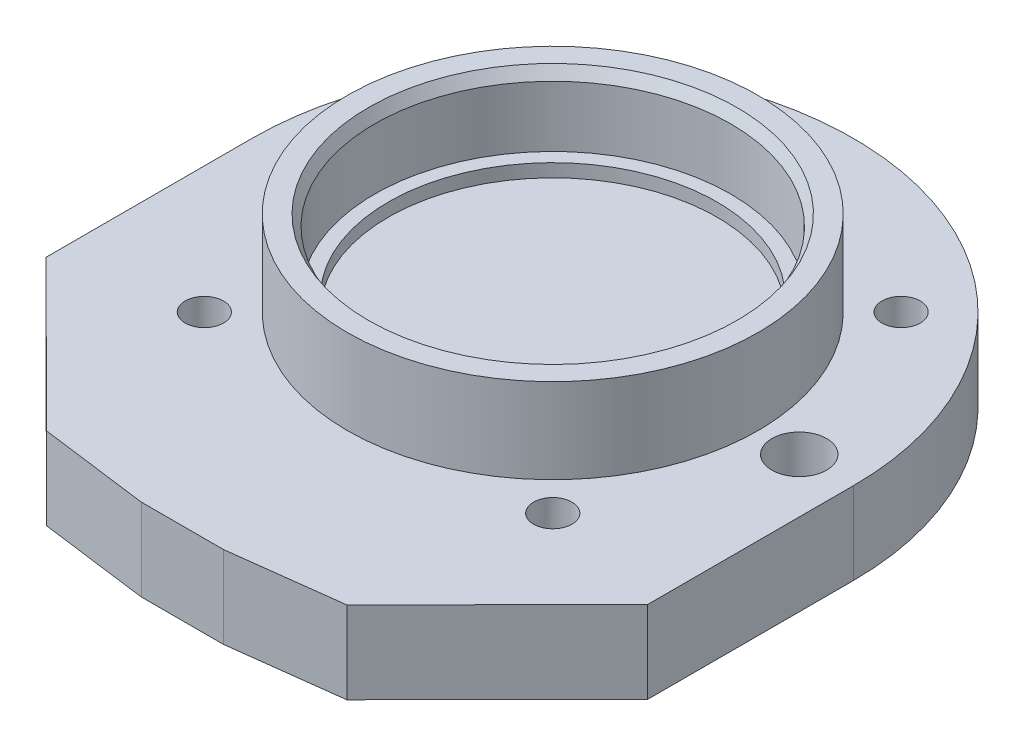
ISO-10303-21;
HEADER;
FILE_DESCRIPTION(('STEP AP214'),'2;1');
FILE_NAME('part.step','',(''),(''),'','','');
FILE_SCHEMA(('AUTOMOTIVE_DESIGN { 1 0 10303 214 1 1 1 1 }'));
ENDSEC;
DATA;
#1=APPLICATION_CONTEXT('core data for automotive mechanical design processes');
#2=APPLICATION_PROTOCOL_DEFINITION('international standard','automotive_design',2000,#1);
#3=PRODUCT_CONTEXT('',#1,'mechanical');
#4=PRODUCT('Part','Part','',(#3));
#5=PRODUCT_RELATED_PRODUCT_CATEGORY('part','',(#4));
#6=PRODUCT_DEFINITION_FORMATION('','',#4);
#7=PRODUCT_DEFINITION_CONTEXT('part definition',#1,'design');
#8=PRODUCT_DEFINITION('design','',#6,#7);
#9=PRODUCT_DEFINITION_SHAPE('','',#8);
#10=(LENGTH_UNIT() NAMED_UNIT(*) SI_UNIT(.MILLI.,.METRE.));
#11=(NAMED_UNIT(*) PLANE_ANGLE_UNIT() SI_UNIT($,.RADIAN.));
#12=(NAMED_UNIT(*) SI_UNIT($,.STERADIAN.) SOLID_ANGLE_UNIT());
#13=UNCERTAINTY_MEASURE_WITH_UNIT(LENGTH_MEASURE(1.E-05),#10,'distance_accuracy_value','');
#14=(GEOMETRIC_REPRESENTATION_CONTEXT(3) GLOBAL_UNCERTAINTY_ASSIGNED_CONTEXT((#13)) GLOBAL_UNIT_ASSIGNED_CONTEXT((#10,
#11,#12)) REPRESENTATION_CONTEXT('',''));
#15=CARTESIAN_POINT('',(0.,0.,0.));
#16=DIRECTION('',(0.,0.,1.));
#17=DIRECTION('',(1.,0.,0.));
#18=AXIS2_PLACEMENT_3D('',#15,#16,#17);
#19=CARTESIAN_POINT('',(0.,30.,0.));
#20=DIRECTION('',(0.,1.,0.));
#21=DIRECTION('',(0.,0.,1.));
#22=AXIS2_PLACEMENT_3D('',#19,#20,#21);
#23=PLANE('',#22);
#24=CARTESIAN_POINT('',(0.,30.,0.));
#25=DIRECTION('',(0.,1.,0.));
#26=DIRECTION('',(0.,0.,1.));
#27=AXIS2_PLACEMENT_3D('',#24,#25,#26);
#28=CIRCLE('',#27,60.);
#29=CARTESIAN_POINT('',(0.,30.,60.));
#30=VERTEX_POINT('',#29);
#31=EDGE_CURVE('E19',#30,#30,#28,.T.);
#32=ORIENTED_EDGE('',*,*,#31,.T.);
#33=EDGE_LOOP('',(#32));
#34=FACE_BOUND('',#33,.T.);
#35=ADVANCED_FACE('F16',(#34),#23,.T.);
#36=CARTESIAN_POINT('',(0.,34.8,0.));
#37=DIRECTION('',(0.,1.,0.));
#38=DIRECTION('',(0.,0.,1.));
#39=AXIS2_PLACEMENT_3D('',#36,#37,#38);
#40=CYLINDRICAL_SURFACE('',#39,60.);
#41=ORIENTED_EDGE('',*,*,#31,.F.);
#42=EDGE_LOOP('',(#41));
#43=FACE_BOUND('',#42,.T.);
#44=CARTESIAN_POINT('',(0.,34.8,0.));
#45=DIRECTION('',(0.,1.,0.));
#46=DIRECTION('',(0.,0.,1.));
#47=AXIS2_PLACEMENT_3D('',#44,#45,#46);
#48=CIRCLE('',#47,60.);
#49=CARTESIAN_POINT('',(0.,34.8,60.));
#50=VERTEX_POINT('',#49);
#51=EDGE_CURVE('E204',#50,#50,#48,.F.);
#52=ORIENTED_EDGE('',*,*,#51,.F.);
#53=EDGE_LOOP('',(#52));
#54=FACE_BOUND('',#53,.T.);
#55=ADVANCED_FACE('F212',(#43,#54),#40,.F.);
#56=CARTESIAN_POINT('',(0.,34.8,0.));
#57=DIRECTION('',(0.,1.,0.));
#58=DIRECTION('',(0.,0.,1.));
#59=AXIS2_PLACEMENT_3D('',#56,#57,#58);
#60=PLANE('',#59);
#61=ORIENTED_EDGE('',*,*,#51,.T.);
#62=EDGE_LOOP('',(#61));
#63=FACE_BOUND('',#62,.T.);
#64=CARTESIAN_POINT('',(0.,34.8,0.));
#65=DIRECTION('',(0.,1.,0.));
#66=DIRECTION('',(0.,0.,1.));
#67=AXIS2_PLACEMENT_3D('',#64,#65,#66);
#68=CIRCLE('',#67,65.);
#69=CARTESIAN_POINT('',(0.,34.8,65.));
#70=VERTEX_POINT('',#69);
#71=EDGE_CURVE('E202',#70,#70,#68,.T.);
#72=ORIENTED_EDGE('',*,*,#71,.T.);
#73=EDGE_LOOP('',(#72));
#74=FACE_BOUND('',#73,.T.);
#75=ADVANCED_FACE('F215',(#63,#74),#60,.T.);
#76=CARTESIAN_POINT('',(0.,61.,0.));
#77=DIRECTION('',(0.,1.,0.));
#78=DIRECTION('',(0.,0.,1.));
#79=AXIS2_PLACEMENT_3D('',#76,#77,#78);
#80=CYLINDRICAL_SURFACE('',#79,65.);
#81=ORIENTED_EDGE('',*,*,#71,.F.);
#82=EDGE_LOOP('',(#81));
#83=FACE_BOUND('',#82,.T.);
#84=CARTESIAN_POINT('',(4.90274487674E-13,56.999925434073,0.));
#85=DIRECTION('',(0.,1.,0.));
#86=DIRECTION('',(0.,0.,1.));
#87=AXIS2_PLACEMENT_3D('',#84,#85,#86);
#88=CIRCLE('',#87,65.);
#89=CARTESIAN_POINT('',(4.90274487674E-13,56.999925434073,64.9999999999999));
#90=VERTEX_POINT('',#89);
#91=EDGE_CURVE('E199',#90,#90,#88,.T.);
#92=ORIENTED_EDGE('',*,*,#91,.T.);
#93=EDGE_LOOP('',(#92));
#94=FACE_BOUND('',#93,.T.);
#95=ADVANCED_FACE('F221',(#83,#94),#80,.F.);
#96=CARTESIAN_POINT('',(4.90274487674E-13,60.9999806962001,0.));
#97=DIRECTION('',(0.,1.,0.));
#98=DIRECTION('',(0.,0.,1.));
#99=AXIS2_PLACEMENT_3D('',#96,#97,#98);
#100=CONICAL_SURFACE('',#99,67.3094345119396,0.523599062390001);
#101=ORIENTED_EDGE('',*,*,#91,.F.);
#102=EDGE_LOOP('',(#101));
#103=FACE_BOUND('',#102,.T.);
#104=CARTESIAN_POINT('',(4.90274487674E-13,61.,0.));
#105=DIRECTION('',(0.,1.,0.));
#106=DIRECTION('',(0.,0.,1.));
#107=AXIS2_PLACEMENT_3D('',#104,#105,#106);
#108=CIRCLE('',#107,67.309445657001);
#109=CARTESIAN_POINT('',(4.90274487674E-13,61.,67.3094456570009));
#110=VERTEX_POINT('',#109);
#111=EDGE_CURVE('E196',#110,#110,#108,.F.);
#112=ORIENTED_EDGE('',*,*,#111,.F.);
#113=EDGE_LOOP('',(#112));
#114=FACE_BOUND('',#113,.T.);
#115=ADVANCED_FACE('F321',(#103,#114),#100,.F.);
#116=CARTESIAN_POINT('',(0.,61.,0.));
#117=DIRECTION('',(0.,1.,0.));
#118=DIRECTION('',(0.,0.,1.));
#119=AXIS2_PLACEMENT_3D('',#116,#117,#118);
#120=PLANE('',#119);
#121=ORIENTED_EDGE('',*,*,#111,.T.);
#122=EDGE_LOOP('',(#121));
#123=FACE_BOUND('',#122,.T.);
#124=CARTESIAN_POINT('',(0.,61.,0.));
#125=DIRECTION('',(0.,1.,0.));
#126=DIRECTION('',(0.,0.,1.));
#127=AXIS2_PLACEMENT_3D('',#124,#125,#126);
#128=CIRCLE('',#127,75.);
#129=CARTESIAN_POINT('',(0.,61.,75.));
#130=VERTEX_POINT('',#129);
#131=EDGE_CURVE('E193',#130,#130,#128,.F.);
#132=ORIENTED_EDGE('',*,*,#131,.F.);
#133=EDGE_LOOP('',(#132));
#134=FACE_BOUND('',#133,.T.);
#135=ADVANCED_FACE('F317',(#123,#134),#120,.T.);
#136=CARTESIAN_POINT('',(0.,30.,0.));
#137=DIRECTION('',(0.,1.,0.));
#138=DIRECTION('',(0.,0.,1.));
#139=AXIS2_PLACEMENT_3D('',#136,#137,#138);
#140=CYLINDRICAL_SURFACE('',#139,75.);
#141=ORIENTED_EDGE('',*,*,#131,.T.);
#142=EDGE_LOOP('',(#141));
#143=FACE_BOUND('',#142,.T.);
#144=CARTESIAN_POINT('',(0.,30.,0.));
#145=DIRECTION('',(0.,1.,0.));
#146=DIRECTION('',(0.,0.,1.));
#147=AXIS2_PLACEMENT_3D('',#144,#145,#146);
#148=CIRCLE('',#147,75.);
#149=CARTESIAN_POINT('',(0.,30.,75.));
#150=VERTEX_POINT('',#149);
#151=EDGE_CURVE('E178',#150,#150,#148,.F.);
#152=ORIENTED_EDGE('',*,*,#151,.F.);
#153=EDGE_LOOP('',(#152));
#154=FACE_BOUND('',#153,.T.);
#155=ADVANCED_FACE('F313',(#143,#154),#140,.T.);
#156=CARTESIAN_POINT('',(-63.6,16.,-63.6));
#157=DIRECTION('',(0.,-1.,0.));
#158=DIRECTION('',(0.,0.,-1.));
#159=AXIS2_PLACEMENT_3D('',#156,#157,#158);
#160=CYLINDRICAL_SURFACE('',#159,7.);
#161=CARTESIAN_POINT('',(-63.6,16.,-63.6));
#162=DIRECTION('',(0.,-1.,0.));
#163=DIRECTION('',(0.,0.,-1.));
#164=AXIS2_PLACEMENT_3D('',#161,#162,#163);
#165=CIRCLE('',#164,7.);
#166=CARTESIAN_POINT('',(-63.6,16.,-70.6));
#167=VERTEX_POINT('',#166);
#168=EDGE_CURVE('E190',#167,#167,#165,.F.);
#169=ORIENTED_EDGE('',*,*,#168,.F.);
#170=EDGE_LOOP('',(#169));
#171=FACE_BOUND('',#170,.T.);
#172=CARTESIAN_POINT('',(-63.6,30.,-63.6));
#173=DIRECTION('',(0.,-1.,0.));
#174=DIRECTION('',(0.,0.,-1.));
#175=AXIS2_PLACEMENT_3D('',#172,#173,#174);
#176=CIRCLE('',#175,7.);
#177=CARTESIAN_POINT('',(-63.6,30.,-70.6));
#178=VERTEX_POINT('',#177);
#179=EDGE_CURVE('E175',#178,#178,#176,.T.);
#180=ORIENTED_EDGE('',*,*,#179,.F.);
#181=EDGE_LOOP('',(#180));
#182=FACE_BOUND('',#181,.T.);
#183=ADVANCED_FACE('F309',(#171,#182),#160,.F.);
#184=CARTESIAN_POINT('',(-63.6,16.,63.6));
#185=DIRECTION('',(0.,-1.,0.));
#186=DIRECTION('',(0.,0.,-1.));
#187=AXIS2_PLACEMENT_3D('',#184,#185,#186);
#188=CYLINDRICAL_SURFACE('',#187,7.);
#189=CARTESIAN_POINT('',(-63.6,16.,63.6));
#190=DIRECTION('',(0.,-1.,0.));
#191=DIRECTION('',(0.,0.,-1.));
#192=AXIS2_PLACEMENT_3D('',#189,#190,#191);
#193=CIRCLE('',#192,7.);
#194=CARTESIAN_POINT('',(-63.6,16.,56.6));
#195=VERTEX_POINT('',#194);
#196=EDGE_CURVE('E187',#195,#195,#193,.F.);
#197=ORIENTED_EDGE('',*,*,#196,.F.);
#198=EDGE_LOOP('',(#197));
#199=FACE_BOUND('',#198,.T.);
#200=CARTESIAN_POINT('',(-63.6,30.,63.6));
#201=DIRECTION('',(0.,-1.,0.));
#202=DIRECTION('',(0.,0.,-1.));
#203=AXIS2_PLACEMENT_3D('',#200,#201,#202);
#204=CIRCLE('',#203,7.);
#205=CARTESIAN_POINT('',(-63.6,30.,56.6));
#206=VERTEX_POINT('',#205);
#207=EDGE_CURVE('E172',#206,#206,#204,.T.);
#208=ORIENTED_EDGE('',*,*,#207,.F.);
#209=EDGE_LOOP('',(#208));
#210=FACE_BOUND('',#209,.T.);
#211=ADVANCED_FACE('F305',(#199,#210),#188,.F.);
#212=CARTESIAN_POINT('',(63.6,16.,63.6));
#213=DIRECTION('',(0.,-1.,0.));
#214=DIRECTION('',(0.,0.,-1.));
#215=AXIS2_PLACEMENT_3D('',#212,#213,#214);
#216=CYLINDRICAL_SURFACE('',#215,7.);
#217=CARTESIAN_POINT('',(63.6,16.,63.6));
#218=DIRECTION('',(0.,-1.,0.));
#219=DIRECTION('',(0.,0.,-1.));
#220=AXIS2_PLACEMENT_3D('',#217,#218,#219);
#221=CIRCLE('',#220,7.);
#222=CARTESIAN_POINT('',(63.6,16.,56.6));
#223=VERTEX_POINT('',#222);
#224=EDGE_CURVE('E184',#223,#223,#221,.F.);
#225=ORIENTED_EDGE('',*,*,#224,.F.);
#226=EDGE_LOOP('',(#225));
#227=FACE_BOUND('',#226,.T.);
#228=CARTESIAN_POINT('',(63.6,30.,63.6));
#229=DIRECTION('',(0.,-1.,0.));
#230=DIRECTION('',(0.,0.,-1.));
#231=AXIS2_PLACEMENT_3D('',#228,#229,#230);
#232=CIRCLE('',#231,7.);
#233=CARTESIAN_POINT('',(63.6,30.,56.6));
#234=VERTEX_POINT('',#233);
#235=EDGE_CURVE('E169',#234,#234,#232,.T.);
#236=ORIENTED_EDGE('',*,*,#235,.F.);
#237=EDGE_LOOP('',(#236));
#238=FACE_BOUND('',#237,.T.);
#239=ADVANCED_FACE('F301',(#227,#238),#216,.F.);
#240=CARTESIAN_POINT('',(63.6,16.,-63.6));
#241=DIRECTION('',(0.,-1.,0.));
#242=DIRECTION('',(0.,0.,-1.));
#243=AXIS2_PLACEMENT_3D('',#240,#241,#242);
#244=CYLINDRICAL_SURFACE('',#243,7.);
#245=CARTESIAN_POINT('',(63.6,16.,-63.6));
#246=DIRECTION('',(0.,-1.,0.));
#247=DIRECTION('',(0.,0.,-1.));
#248=AXIS2_PLACEMENT_3D('',#245,#246,#247);
#249=CIRCLE('',#248,7.);
#250=CARTESIAN_POINT('',(63.6,16.,-70.6));
#251=VERTEX_POINT('',#250);
#252=EDGE_CURVE('E181',#251,#251,#249,.F.);
#253=ORIENTED_EDGE('',*,*,#252,.F.);
#254=EDGE_LOOP('',(#253));
#255=FACE_BOUND('',#254,.T.);
#256=CARTESIAN_POINT('',(63.6,30.,-63.6));
#257=DIRECTION('',(0.,-1.,0.));
#258=DIRECTION('',(0.,0.,-1.));
#259=AXIS2_PLACEMENT_3D('',#256,#257,#258);
#260=CIRCLE('',#259,7.);
#261=CARTESIAN_POINT('',(63.6,30.,-70.6));
#262=VERTEX_POINT('',#261);
#263=EDGE_CURVE('E98',#262,#262,#260,.T.);
#264=ORIENTED_EDGE('',*,*,#263,.F.);
#265=EDGE_LOOP('',(#264));
#266=FACE_BOUND('',#265,.T.);
#267=ADVANCED_FACE('F297',(#255,#266),#244,.F.);
#268=CARTESIAN_POINT('',(0.,16.,0.));
#269=DIRECTION('',(0.,-1.,0.));
#270=DIRECTION('',(0.,0.,-1.));
#271=AXIS2_PLACEMENT_3D('',#268,#269,#270);
#272=PLANE('',#271);
#273=ORIENTED_EDGE('',*,*,#168,.T.);
#274=EDGE_LOOP('',(#273));
#275=FACE_BOUND('',#274,.T.);
#276=CARTESIAN_POINT('',(-63.6,16.,-63.6));
#277=DIRECTION('',(0.,-1.,0.));
#278=DIRECTION('',(0.,0.,-1.));
#279=AXIS2_PLACEMENT_3D('',#276,#277,#278);
#280=CIRCLE('',#279,10.);
#281=CARTESIAN_POINT('',(-63.6,16.,-73.6));
#282=VERTEX_POINT('',#281);
#283=EDGE_CURVE('E164',#282,#282,#280,.T.);
#284=ORIENTED_EDGE('',*,*,#283,.T.);
#285=EDGE_LOOP('',(#284));
#286=FACE_BOUND('',#285,.T.);
#287=ADVANCED_FACE('F293',(#275,#286),#272,.T.);
#288=CARTESIAN_POINT('',(0.,16.,0.));
#289=DIRECTION('',(0.,-1.,0.));
#290=DIRECTION('',(0.,0.,-1.));
#291=AXIS2_PLACEMENT_3D('',#288,#289,#290);
#292=PLANE('',#291);
#293=ORIENTED_EDGE('',*,*,#196,.T.);
#294=EDGE_LOOP('',(#293));
#295=FACE_BOUND('',#294,.T.);
#296=CARTESIAN_POINT('',(-63.6,16.,63.6));
#297=DIRECTION('',(0.,-1.,0.));
#298=DIRECTION('',(0.,0.,-1.));
#299=AXIS2_PLACEMENT_3D('',#296,#297,#298);
#300=CIRCLE('',#299,10.);
#301=CARTESIAN_POINT('',(-63.6,16.,53.6));
#302=VERTEX_POINT('',#301);
#303=EDGE_CURVE('E161',#302,#302,#300,.T.);
#304=ORIENTED_EDGE('',*,*,#303,.T.);
#305=EDGE_LOOP('',(#304));
#306=FACE_BOUND('',#305,.T.);
#307=ADVANCED_FACE('F289',(#295,#306),#292,.T.);
#308=CARTESIAN_POINT('',(0.,16.,0.));
#309=DIRECTION('',(0.,-1.,0.));
#310=DIRECTION('',(0.,0.,-1.));
#311=AXIS2_PLACEMENT_3D('',#308,#309,#310);
#312=PLANE('',#311);
#313=ORIENTED_EDGE('',*,*,#224,.T.);
#314=EDGE_LOOP('',(#313));
#315=FACE_BOUND('',#314,.T.);
#316=CARTESIAN_POINT('',(63.6,16.,63.6));
#317=DIRECTION('',(0.,-1.,0.));
#318=DIRECTION('',(0.,0.,-1.));
#319=AXIS2_PLACEMENT_3D('',#316,#317,#318);
#320=CIRCLE('',#319,10.);
#321=CARTESIAN_POINT('',(63.6,16.,53.6));
#322=VERTEX_POINT('',#321);
#323=EDGE_CURVE('E158',#322,#322,#320,.T.);
#324=ORIENTED_EDGE('',*,*,#323,.T.);
#325=EDGE_LOOP('',(#324));
#326=FACE_BOUND('',#325,.T.);
#327=ADVANCED_FACE('F285',(#315,#326),#312,.T.);
#328=CARTESIAN_POINT('',(0.,16.,0.));
#329=DIRECTION('',(0.,-1.,0.));
#330=DIRECTION('',(0.,0.,-1.));
#331=AXIS2_PLACEMENT_3D('',#328,#329,#330);
#332=PLANE('',#331);
#333=ORIENTED_EDGE('',*,*,#252,.T.);
#334=EDGE_LOOP('',(#333));
#335=FACE_BOUND('',#334,.T.);
#336=CARTESIAN_POINT('',(63.6,16.,-63.6));
#337=DIRECTION('',(0.,-1.,0.));
#338=DIRECTION('',(0.,0.,-1.));
#339=AXIS2_PLACEMENT_3D('',#336,#337,#338);
#340=CIRCLE('',#339,10.);
#341=CARTESIAN_POINT('',(63.6,16.,-73.6));
#342=VERTEX_POINT('',#341);
#343=EDGE_CURVE('E155',#342,#342,#340,.T.);
#344=ORIENTED_EDGE('',*,*,#343,.T.);
#345=EDGE_LOOP('',(#344));
#346=FACE_BOUND('',#345,.T.);
#347=ADVANCED_FACE('F281',(#335,#346),#332,.T.);
#348=CARTESIAN_POINT('',(0.,30.,0.));
#349=DIRECTION('',(0.,1.,0.));
#350=DIRECTION('',(0.,0.,1.));
#351=AXIS2_PLACEMENT_3D('',#348,#349,#350);
#352=PLANE('',#351);
#353=CARTESIAN_POINT('',(90.,30.,0.));
#354=DIRECTION('',(0.,-1.,0.));
#355=DIRECTION('',(0.,0.,-1.));
#356=AXIS2_PLACEMENT_3D('',#353,#354,#355);
#357=CIRCLE('',#356,10.);
#358=CARTESIAN_POINT('',(90.,30.,-10.));
#359=VERTEX_POINT('',#358);
#360=EDGE_CURVE('E152',#359,#359,#357,.T.);
#361=ORIENTED_EDGE('',*,*,#360,.T.);
#362=EDGE_LOOP('',(#361));
#363=FACE_BOUND('',#362,.T.);
#364=ORIENTED_EDGE('',*,*,#263,.T.);
#365=EDGE_LOOP('',(#364));
#366=FACE_BOUND('',#365,.T.);
#367=ORIENTED_EDGE('',*,*,#235,.T.);
#368=EDGE_LOOP('',(#367));
#369=FACE_BOUND('',#368,.T.);
#370=ORIENTED_EDGE('',*,*,#207,.T.);
#371=EDGE_LOOP('',(#370));
#372=FACE_BOUND('',#371,.T.);
#373=ORIENTED_EDGE('',*,*,#179,.T.);
#374=EDGE_LOOP('',(#373));
#375=FACE_BOUND('',#374,.T.);
#376=ORIENTED_EDGE('',*,*,#151,.T.);
#377=EDGE_LOOP('',(#376));
#378=FACE_BOUND('',#377,.T.);
#379=DIRECTION('',(0.,0.,-1.));
#380=VECTOR('',#379,1.);
#381=CARTESIAN_POINT('',(109.8,30.,75.2));
#382=LINE('',#381,#380);
#383=CARTESIAN_POINT('',(109.8,30.,0.));
#384=VERTEX_POINT('',#383);
#385=CARTESIAN_POINT('',(109.799999999995,30.,75.1999999999948));
#386=VERTEX_POINT('',#385);
#387=EDGE_CURVE('E94',#384,#386,#382,.F.);
#388=ORIENTED_EDGE('',*,*,#387,.F.);
#389=CARTESIAN_POINT('',(0.,30.,0.));
#390=DIRECTION('',(0.,1.,0.));
#391=DIRECTION('',(0.,0.,1.));
#392=AXIS2_PLACEMENT_3D('',#389,#390,#391);
#393=CIRCLE('',#392,109.8);
#394=CARTESIAN_POINT('',(-109.8,30.,0.));
#395=VERTEX_POINT('',#394);
#396=EDGE_CURVE('E88',#395,#384,#393,.F.);
#397=ORIENTED_EDGE('',*,*,#396,.F.);
#398=DIRECTION('',(0.,0.,1.));
#399=VECTOR('',#398,1.);
#400=CARTESIAN_POINT('',(-109.8,30.,0.));
#401=LINE('',#400,#399);
#402=CARTESIAN_POINT('',(-109.8,30.,75.2));
#403=VERTEX_POINT('',#402);
#404=EDGE_CURVE('E78',#403,#395,#401,.F.);
#405=ORIENTED_EDGE('',*,*,#404,.F.);
#406=DIRECTION('',(0.708393596513729,0.,0.70581761979873));
#407=VECTOR('',#406,1.);
#408=CARTESIAN_POINT('',(-109.8,30.,75.2));
#409=LINE('',#408,#407);
#410=CARTESIAN_POINT('',(-54.7999999999948,30.,129.999999999995));
#411=VERTEX_POINT('',#410);
#412=EDGE_CURVE('E103',#411,#403,#409,.F.);
#413=ORIENTED_EDGE('',*,*,#412,.F.);
#414=DIRECTION('',(0.991572603304275,0.,0.129552199427036));
#415=VECTOR('',#414,1.);
#416=CARTESIAN_POINT('',(-54.8,30.,130.));
#417=LINE('',#416,#415);
#418=CARTESIAN_POINT('',(-15.0000000000006,30.,135.200000000005));
#419=VERTEX_POINT('',#418);
#420=EDGE_CURVE('E130',#419,#411,#417,.F.);
#421=ORIENTED_EDGE('',*,*,#420,.F.);
#422=DIRECTION('',(1.,0.,0.));
#423=VECTOR('',#422,1.);
#424=CARTESIAN_POINT('',(-15.,30.,135.2));
#425=LINE('',#424,#423);
#426=CARTESIAN_POINT('',(15.,30.,135.2));
#427=VERTEX_POINT('',#426);
#428=EDGE_CURVE('E125',#427,#419,#425,.F.);
#429=ORIENTED_EDGE('',*,*,#428,.F.);
#430=DIRECTION('',(0.992277876713698,0.,-0.124034734588962));
#431=VECTOR('',#430,1.);
#432=CARTESIAN_POINT('',(15.,30.,135.2));
#433=LINE('',#432,#431);
#434=CARTESIAN_POINT('',(55.0000000000004,30.,130.200000000003));
#435=VERTEX_POINT('',#434);
#436=EDGE_CURVE('E120',#435,#427,#433,.F.);
#437=ORIENTED_EDGE('',*,*,#436,.F.);
#438=DIRECTION('',(0.70581761979873,0.,-0.708393596513729));
#439=VECTOR('',#438,1.);
#440=CARTESIAN_POINT('',(55.,30.,130.2));
#441=LINE('',#440,#439);
#442=EDGE_CURVE('E110',#386,#435,#441,.F.);
#443=ORIENTED_EDGE('',*,*,#442,.F.);
#444=EDGE_LOOP('',(#388,#397,#405,#413,#421,#429,#437,#443));
#445=FACE_BOUND('',#444,.T.);
#446=ADVANCED_FACE('F92',(#363,#366,#369,#372,#375,#378,#445),#352,.T.);
#447=CARTESIAN_POINT('',(0.,0.,0.));
#448=DIRECTION('',(0.,1.,0.));
#449=DIRECTION('',(0.,0.,1.));
#450=AXIS2_PLACEMENT_3D('',#447,#448,#449);
#451=CYLINDRICAL_SURFACE('',#450,109.8);
#452=DIRECTION('',(0.,1.,0.));
#453=VECTOR('',#452,1.);
#454=CARTESIAN_POINT('',(109.8,0.,0.));
#455=LINE('',#454,#453);
#456=CARTESIAN_POINT('',(109.8,0.,0.));
#457=VERTEX_POINT('',#456);
#458=EDGE_CURVE('E117',#457,#384,#455,.T.);
#459=ORIENTED_EDGE('',*,*,#458,.F.);
#460=CARTESIAN_POINT('',(0.,0.,0.));
#461=DIRECTION('',(0.,1.,0.));
#462=DIRECTION('',(0.,0.,1.));
#463=AXIS2_PLACEMENT_3D('',#460,#461,#462);
#464=CIRCLE('',#463,109.8);
#465=CARTESIAN_POINT('',(-109.8,0.,0.));
#466=VERTEX_POINT('',#465);
#467=EDGE_CURVE('E102',#457,#466,#464,.T.);
#468=ORIENTED_EDGE('',*,*,#467,.T.);
#469=DIRECTION('',(0.,1.,0.));
#470=VECTOR('',#469,1.);
#471=CARTESIAN_POINT('',(-109.8,0.,0.));
#472=LINE('',#471,#470);
#473=EDGE_CURVE('E83',#395,#466,#472,.F.);
#474=ORIENTED_EDGE('',*,*,#473,.F.);
#475=ORIENTED_EDGE('',*,*,#396,.T.);
#476=EDGE_LOOP('',(#459,#468,#474,#475));
#477=FACE_BOUND('',#476,.T.);
#478=ADVANCED_FACE('F101',(#477),#451,.T.);
#479=CARTESIAN_POINT('',(-109.8,0.,0.));
#480=DIRECTION('',(-1.,0.,0.));
#481=DIRECTION('',(0.,0.,1.));
#482=AXIS2_PLACEMENT_3D('',#479,#480,#481);
#483=PLANE('',#482);
#484=ORIENTED_EDGE('',*,*,#473,.T.);
#485=DIRECTION('',(0.,0.,1.));
#486=VECTOR('',#485,1.);
#487=CARTESIAN_POINT('',(-109.8,0.,0.));
#488=LINE('',#487,#486);
#489=CARTESIAN_POINT('',(-109.8,0.,75.2));
#490=VERTEX_POINT('',#489);
#491=EDGE_CURVE('E151',#466,#490,#488,.T.);
#492=ORIENTED_EDGE('',*,*,#491,.T.);
#493=DIRECTION('',(0.,1.,0.));
#494=VECTOR('',#493,1.);
#495=CARTESIAN_POINT('',(-109.8,0.,75.2));
#496=LINE('',#495,#494);
#497=EDGE_CURVE('E85',#403,#490,#496,.F.);
#498=ORIENTED_EDGE('',*,*,#497,.F.);
#499=ORIENTED_EDGE('',*,*,#404,.T.);
#500=EDGE_LOOP('',(#484,#492,#498,#499));
#501=FACE_BOUND('',#500,.T.);
#502=ADVANCED_FACE('F80',(#501),#483,.T.);
#503=CARTESIAN_POINT('',(-109.8,0.,75.2));
#504=DIRECTION('',(-0.70581761979873,0.,0.708393596513729));
#505=DIRECTION('',(0.708393596513729,0.,0.70581761979873));
#506=AXIS2_PLACEMENT_3D('',#503,#504,#505);
#507=PLANE('',#506);
#508=ORIENTED_EDGE('',*,*,#497,.T.);
#509=DIRECTION('',(0.708393596513527,0.,0.705817619798932));
#510=VECTOR('',#509,1.);
#511=CARTESIAN_POINT('',(-109.8,0.,75.2));
#512=LINE('',#511,#510);
#513=CARTESIAN_POINT('',(-54.8,0.,130.));
#514=VERTEX_POINT('',#513);
#515=EDGE_CURVE('E568',#490,#514,#512,.T.);
#516=ORIENTED_EDGE('',*,*,#515,.T.);
#517=DIRECTION('',(0.,1.,0.));
#518=VECTOR('',#517,1.);
#519=CARTESIAN_POINT('',(-54.8,0.,130.));
#520=LINE('',#519,#518);
#521=EDGE_CURVE('E127',#411,#514,#520,.F.);
#522=ORIENTED_EDGE('',*,*,#521,.F.);
#523=ORIENTED_EDGE('',*,*,#412,.T.);
#524=EDGE_LOOP('',(#508,#516,#522,#523));
#525=FACE_BOUND('',#524,.T.);
#526=ADVANCED_FACE('F270',(#525),#507,.T.);
#527=CARTESIAN_POINT('',(-54.8,0.,130.));
#528=DIRECTION('',(-0.129552199427036,0.,0.991572603304275));
#529=DIRECTION('',(0.991572603304275,0.,0.129552199427036));
#530=AXIS2_PLACEMENT_3D('',#527,#528,#529);
#531=PLANE('',#530);
#532=ORIENTED_EDGE('',*,*,#521,.T.);
#533=DIRECTION('',(0.99157260330432,0.,0.129552199426695));
#534=VECTOR('',#533,1.);
#535=CARTESIAN_POINT('',(-54.8,0.,130.));
#536=LINE('',#535,#534);
#537=CARTESIAN_POINT('',(-15.,0.,135.2));
#538=VERTEX_POINT('',#537);
#539=EDGE_CURVE('E550',#514,#538,#536,.T.);
#540=ORIENTED_EDGE('',*,*,#539,.T.);
#541=DIRECTION('',(0.,1.,0.));
#542=VECTOR('',#541,1.);
#543=CARTESIAN_POINT('',(-15.,0.,135.2));
#544=LINE('',#543,#542);
#545=EDGE_CURVE('E122',#419,#538,#544,.F.);
#546=ORIENTED_EDGE('',*,*,#545,.F.);
#547=ORIENTED_EDGE('',*,*,#420,.T.);
#548=EDGE_LOOP('',(#532,#540,#546,#547));
#549=FACE_BOUND('',#548,.T.);
#550=ADVANCED_FACE('F266',(#549),#531,.T.);
#551=CARTESIAN_POINT('',(-15.,0.,135.2));
#552=DIRECTION('',(0.,0.,1.));
#553=DIRECTION('',(1.,0.,0.));
#554=AXIS2_PLACEMENT_3D('',#551,#552,#553);
#555=PLANE('',#554);
#556=ORIENTED_EDGE('',*,*,#545,.T.);
#557=DIRECTION('',(1.,0.,0.));
#558=VECTOR('',#557,1.);
#559=CARTESIAN_POINT('',(0.,0.,135.2));
#560=LINE('',#559,#558);
#561=CARTESIAN_POINT('',(15.,0.,135.2));
#562=VERTEX_POINT('',#561);
#563=EDGE_CURVE('E548',#538,#562,#560,.T.);
#564=ORIENTED_EDGE('',*,*,#563,.T.);
#565=DIRECTION('',(0.,1.,0.));
#566=VECTOR('',#565,1.);
#567=CARTESIAN_POINT('',(15.,0.,135.2));
#568=LINE('',#567,#566);
#569=EDGE_CURVE('E113',#427,#562,#568,.F.);
#570=ORIENTED_EDGE('',*,*,#569,.F.);
#571=ORIENTED_EDGE('',*,*,#428,.T.);
#572=EDGE_LOOP('',(#556,#564,#570,#571));
#573=FACE_BOUND('',#572,.T.);
#574=ADVANCED_FACE('F262',(#573),#555,.T.);
#575=CARTESIAN_POINT('',(15.,0.,135.2));
#576=DIRECTION('',(0.124034734588962,0.,0.992277876713698));
#577=DIRECTION('',(0.992277876713698,0.,-0.124034734588962));
#578=AXIS2_PLACEMENT_3D('',#575,#576,#577);
#579=PLANE('',#578);
#580=ORIENTED_EDGE('',*,*,#569,.T.);
#581=DIRECTION('',(0.992277876713668,0.,-0.124034734589209));
#582=VECTOR('',#581,1.);
#583=CARTESIAN_POINT('',(15.,0.,135.2));
#584=LINE('',#583,#582);
#585=CARTESIAN_POINT('',(55.,0.,130.2));
#586=VERTEX_POINT('',#585);
#587=EDGE_CURVE('E543',#562,#586,#584,.T.);
#588=ORIENTED_EDGE('',*,*,#587,.T.);
#589=DIRECTION('',(0.,1.,0.));
#590=VECTOR('',#589,1.);
#591=CARTESIAN_POINT('',(55.,0.,130.2));
#592=LINE('',#591,#590);
#593=EDGE_CURVE('E112',#435,#586,#592,.F.);
#594=ORIENTED_EDGE('',*,*,#593,.F.);
#595=ORIENTED_EDGE('',*,*,#436,.T.);
#596=EDGE_LOOP('',(#580,#588,#594,#595));
#597=FACE_BOUND('',#596,.T.);
#598=ADVANCED_FACE('F258',(#597),#579,.T.);
#599=CARTESIAN_POINT('',(55.,0.,130.2));
#600=DIRECTION('',(0.708393596513729,0.,0.70581761979873));
#601=DIRECTION('',(0.70581761979873,0.,-0.708393596513729));
#602=AXIS2_PLACEMENT_3D('',#599,#600,#601);
#603=PLANE('',#602);
#604=ORIENTED_EDGE('',*,*,#593,.T.);
#605=DIRECTION('',(0.705817619798933,0.,-0.708393596513527));
#606=VECTOR('',#605,1.);
#607=CARTESIAN_POINT('',(55.,0.,130.2));
#608=LINE('',#607,#606);
#609=CARTESIAN_POINT('',(109.8,0.,75.2));
#610=VERTEX_POINT('',#609);
#611=EDGE_CURVE('E540',#586,#610,#608,.T.);
#612=ORIENTED_EDGE('',*,*,#611,.T.);
#613=DIRECTION('',(0.,1.,0.));
#614=VECTOR('',#613,1.);
#615=CARTESIAN_POINT('',(109.8,0.,75.2));
#616=LINE('',#615,#614);
#617=EDGE_CURVE('E34',#386,#610,#616,.F.);
#618=ORIENTED_EDGE('',*,*,#617,.F.);
#619=ORIENTED_EDGE('',*,*,#442,.T.);
#620=EDGE_LOOP('',(#604,#612,#618,#619));
#621=FACE_BOUND('',#620,.T.);
#622=ADVANCED_FACE('F255',(#621),#603,.T.);
#623=CARTESIAN_POINT('',(109.8,0.,75.2));
#624=DIRECTION('',(1.,0.,0.));
#625=DIRECTION('',(0.,0.,-1.));
#626=AXIS2_PLACEMENT_3D('',#623,#624,#625);
#627=PLANE('',#626);
#628=ORIENTED_EDGE('',*,*,#617,.T.);
#629=DIRECTION('',(0.,0.,1.));
#630=VECTOR('',#629,1.);
#631=CARTESIAN_POINT('',(109.8,0.,0.));
#632=LINE('',#631,#630);
#633=EDGE_CURVE('E149',#610,#457,#632,.F.);
#634=ORIENTED_EDGE('',*,*,#633,.T.);
#635=ORIENTED_EDGE('',*,*,#458,.T.);
#636=ORIENTED_EDGE('',*,*,#387,.T.);
#637=EDGE_LOOP('',(#628,#634,#635,#636));
#638=FACE_BOUND('',#637,.T.);
#639=ADVANCED_FACE('F251',(#638),#627,.T.);
#640=CARTESIAN_POINT('',(-63.6,0.,-63.6));
#641=DIRECTION('',(0.,-1.,0.));
#642=DIRECTION('',(0.,0.,-1.));
#643=AXIS2_PLACEMENT_3D('',#640,#641,#642);
#644=CYLINDRICAL_SURFACE('',#643,10.);
#645=ORIENTED_EDGE('',*,*,#283,.F.);
#646=EDGE_LOOP('',(#645));
#647=FACE_BOUND('',#646,.T.);
#648=CARTESIAN_POINT('',(-63.6,0.,-63.6));
#649=DIRECTION('',(0.,-1.,0.));
#650=DIRECTION('',(0.,0.,-1.));
#651=AXIS2_PLACEMENT_3D('',#648,#649,#650);
#652=CIRCLE('',#651,10.);
#653=CARTESIAN_POINT('',(-63.6,0.,-73.6));
#654=VERTEX_POINT('',#653);
#655=EDGE_CURVE('E146',#654,#654,#652,.T.);
#656=ORIENTED_EDGE('',*,*,#655,.T.);
#657=EDGE_LOOP('',(#656));
#658=FACE_BOUND('',#657,.T.);
#659=ADVANCED_FACE('F247',(#647,#658),#644,.F.);
#660=CARTESIAN_POINT('',(-63.6,0.,63.6));
#661=DIRECTION('',(0.,-1.,0.));
#662=DIRECTION('',(0.,0.,-1.));
#663=AXIS2_PLACEMENT_3D('',#660,#661,#662);
#664=CYLINDRICAL_SURFACE('',#663,10.);
#665=ORIENTED_EDGE('',*,*,#303,.F.);
#666=EDGE_LOOP('',(#665));
#667=FACE_BOUND('',#666,.T.);
#668=CARTESIAN_POINT('',(-63.6,0.,63.6));
#669=DIRECTION('',(0.,-1.,0.));
#670=DIRECTION('',(0.,0.,-1.));
#671=AXIS2_PLACEMENT_3D('',#668,#669,#670);
#672=CIRCLE('',#671,10.);
#673=CARTESIAN_POINT('',(-63.6,0.,53.6));
#674=VERTEX_POINT('',#673);
#675=EDGE_CURVE('E143',#674,#674,#672,.T.);
#676=ORIENTED_EDGE('',*,*,#675,.T.);
#677=EDGE_LOOP('',(#676));
#678=FACE_BOUND('',#677,.T.);
#679=ADVANCED_FACE('F243',(#667,#678),#664,.F.);
#680=CARTESIAN_POINT('',(63.6,0.,63.6));
#681=DIRECTION('',(0.,-1.,0.));
#682=DIRECTION('',(0.,0.,-1.));
#683=AXIS2_PLACEMENT_3D('',#680,#681,#682);
#684=CYLINDRICAL_SURFACE('',#683,10.);
#685=ORIENTED_EDGE('',*,*,#323,.F.);
#686=EDGE_LOOP('',(#685));
#687=FACE_BOUND('',#686,.T.);
#688=CARTESIAN_POINT('',(63.6,0.,63.6));
#689=DIRECTION('',(0.,-1.,0.));
#690=DIRECTION('',(0.,0.,-1.));
#691=AXIS2_PLACEMENT_3D('',#688,#689,#690);
#692=CIRCLE('',#691,10.);
#693=CARTESIAN_POINT('',(63.6,0.,53.6));
#694=VERTEX_POINT('',#693);
#695=EDGE_CURVE('E140',#694,#694,#692,.T.);
#696=ORIENTED_EDGE('',*,*,#695,.T.);
#697=EDGE_LOOP('',(#696));
#698=FACE_BOUND('',#697,.T.);
#699=ADVANCED_FACE('F239',(#687,#698),#684,.F.);
#700=CARTESIAN_POINT('',(63.6,0.,-63.6));
#701=DIRECTION('',(0.,-1.,0.));
#702=DIRECTION('',(0.,0.,-1.));
#703=AXIS2_PLACEMENT_3D('',#700,#701,#702);
#704=CYLINDRICAL_SURFACE('',#703,10.);
#705=ORIENTED_EDGE('',*,*,#343,.F.);
#706=EDGE_LOOP('',(#705));
#707=FACE_BOUND('',#706,.T.);
#708=CARTESIAN_POINT('',(63.6,0.,-63.6));
#709=DIRECTION('',(0.,-1.,0.));
#710=DIRECTION('',(0.,0.,-1.));
#711=AXIS2_PLACEMENT_3D('',#708,#709,#710);
#712=CIRCLE('',#711,10.);
#713=CARTESIAN_POINT('',(63.6,0.,-73.6));
#714=VERTEX_POINT('',#713);
#715=EDGE_CURVE('E25',#714,#714,#712,.T.);
#716=ORIENTED_EDGE('',*,*,#715,.T.);
#717=EDGE_LOOP('',(#716));
#718=FACE_BOUND('',#717,.T.);
#719=ADVANCED_FACE('F231',(#707,#718),#704,.F.);
#720=CARTESIAN_POINT('',(90.,0.,0.));
#721=DIRECTION('',(0.,-1.,0.));
#722=DIRECTION('',(0.,0.,-1.));
#723=AXIS2_PLACEMENT_3D('',#720,#721,#722);
#724=CYLINDRICAL_SURFACE('',#723,10.);
#725=ORIENTED_EDGE('',*,*,#360,.F.);
#726=EDGE_LOOP('',(#725));
#727=FACE_BOUND('',#726,.T.);
#728=CARTESIAN_POINT('',(90.,0.,0.));
#729=DIRECTION('',(0.,-1.,0.));
#730=DIRECTION('',(0.,0.,-1.));
#731=AXIS2_PLACEMENT_3D('',#728,#729,#730);
#732=CIRCLE('',#731,10.);
#733=CARTESIAN_POINT('',(90.,0.,-10.));
#734=VERTEX_POINT('',#733);
#735=EDGE_CURVE('E11',#734,#734,#732,.T.);
#736=ORIENTED_EDGE('',*,*,#735,.T.);
#737=EDGE_LOOP('',(#736));
#738=FACE_BOUND('',#737,.T.);
#739=ADVANCED_FACE('F225',(#727,#738),#724,.F.);
#740=CARTESIAN_POINT('',(0.,0.,0.));
#741=DIRECTION('',(0.,1.,0.));
#742=DIRECTION('',(0.,0.,1.));
#743=AXIS2_PLACEMENT_3D('',#740,#741,#742);
#744=PLANE('',#743);
#745=ORIENTED_EDGE('',*,*,#735,.F.);
#746=EDGE_LOOP('',(#745));
#747=FACE_BOUND('',#746,.T.);
#748=ORIENTED_EDGE('',*,*,#715,.F.);
#749=EDGE_LOOP('',(#748));
#750=FACE_BOUND('',#749,.T.);
#751=ORIENTED_EDGE('',*,*,#695,.F.);
#752=EDGE_LOOP('',(#751));
#753=FACE_BOUND('',#752,.T.);
#754=ORIENTED_EDGE('',*,*,#675,.F.);
#755=EDGE_LOOP('',(#754));
#756=FACE_BOUND('',#755,.T.);
#757=ORIENTED_EDGE('',*,*,#655,.F.);
#758=EDGE_LOOP('',(#757));
#759=FACE_BOUND('',#758,.T.);
#760=ORIENTED_EDGE('',*,*,#611,.F.);
#761=ORIENTED_EDGE('',*,*,#587,.F.);
#762=ORIENTED_EDGE('',*,*,#563,.F.);
#763=ORIENTED_EDGE('',*,*,#539,.F.);
#764=ORIENTED_EDGE('',*,*,#515,.F.);
#765=ORIENTED_EDGE('',*,*,#491,.F.);
#766=ORIENTED_EDGE('',*,*,#467,.F.);
#767=ORIENTED_EDGE('',*,*,#633,.F.);
#768=EDGE_LOOP('',(#760,#761,#762,#763,#764,#765,#766,#767));
#769=FACE_BOUND('',#768,.T.);
#770=ADVANCED_FACE('F223',(#747,#750,#753,#756,#759,#769),#744,.F.);
#771=CLOSED_SHELL('',(#35,#55,#75,#95,#115,#135,#155,#183,#211,#239,#267,#287,#307,#327,#347,
#446,#478,#502,#526,#550,#574,#598,#622,#639,#659,#679,#699,#719,#739,#770));
#772=MANIFOLD_SOLID_BREP('B1',#771);
#773=ADVANCED_BREP_SHAPE_REPRESENTATION('',(#18,#772),#14);
#774=SHAPE_DEFINITION_REPRESENTATION(#9,#773);
ENDSEC;
END-ISO-10303-21;
